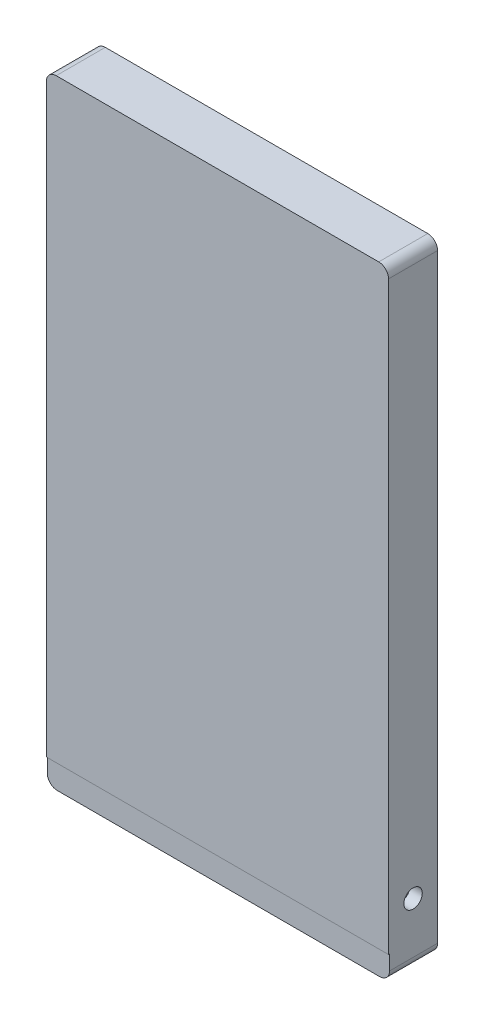
ISO-10303-21;
HEADER;
FILE_DESCRIPTION(('STEP AP214'),'2;1');
FILE_NAME('part.step','',(''),(''),'','','');
FILE_SCHEMA(('AUTOMOTIVE_DESIGN { 1 0 10303 214 1 1 1 1 }'));
ENDSEC;
DATA;
#1=APPLICATION_CONTEXT('core data for automotive mechanical design processes');
#2=APPLICATION_PROTOCOL_DEFINITION('international standard','automotive_design',2000,#1);
#3=PRODUCT_CONTEXT('',#1,'mechanical');
#4=PRODUCT('Part','Part','',(#3));
#5=PRODUCT_RELATED_PRODUCT_CATEGORY('part','',(#4));
#6=PRODUCT_DEFINITION_FORMATION('','',#4);
#7=PRODUCT_DEFINITION_CONTEXT('part definition',#1,'design');
#8=PRODUCT_DEFINITION('design','',#6,#7);
#9=PRODUCT_DEFINITION_SHAPE('','',#8);
#10=(LENGTH_UNIT() NAMED_UNIT(*) SI_UNIT(.MILLI.,.METRE.));
#11=(NAMED_UNIT(*) PLANE_ANGLE_UNIT() SI_UNIT($,.RADIAN.));
#12=(NAMED_UNIT(*) SI_UNIT($,.STERADIAN.) SOLID_ANGLE_UNIT());
#13=UNCERTAINTY_MEASURE_WITH_UNIT(LENGTH_MEASURE(1.E-05),#10,'distance_accuracy_value','');
#14=(GEOMETRIC_REPRESENTATION_CONTEXT(3) GLOBAL_UNCERTAINTY_ASSIGNED_CONTEXT((#13)) GLOBAL_UNIT_ASSIGNED_CONTEXT((#10,
#11,#12)) REPRESENTATION_CONTEXT('',''));
#15=CARTESIAN_POINT('',(0.,0.,0.));
#16=DIRECTION('',(0.,0.,1.));
#17=DIRECTION('',(1.,0.,0.));
#18=AXIS2_PLACEMENT_3D('',#15,#16,#17);
#19=CARTESIAN_POINT('',(-3.175,-3.175,12.7));
#20=DIRECTION('',(0.,1.,0.));
#21=DIRECTION('',(0.,0.,1.));
#22=AXIS2_PLACEMENT_3D('',#19,#20,#21);
#23=PLANE('',#22);
#24=DIRECTION('',(-1.,0.,0.));
#25=VECTOR('',#24,1.);
#26=CARTESIAN_POINT('',(-3.175,-3.175,12.4478002282018));
#27=LINE('',#26,#25);
#28=CARTESIAN_POINT('',(85.344,-3.175,12.4478002282018));
#29=VERTEX_POINT('',#28);
#30=CARTESIAN_POINT('',(-3.175,-3.175,12.4478002282018));
#31=VERTEX_POINT('',#30);
#32=EDGE_CURVE('E159',#29,#31,#27,.T.);
#33=ORIENTED_EDGE('',*,*,#32,.F.);
#34=DIRECTION('',(0.,0.,-1.));
#35=VECTOR('',#34,1.);
#36=CARTESIAN_POINT('',(85.344,-3.175,12.7));
#37=LINE('',#36,#35);
#38=CARTESIAN_POINT('',(85.344,-3.175,12.7));
#39=VERTEX_POINT('',#38);
#40=EDGE_CURVE('E165',#39,#29,#37,.T.);
#41=ORIENTED_EDGE('',*,*,#40,.F.);
#42=DIRECTION('',(1.,0.,0.));
#43=VECTOR('',#42,1.);
#44=CARTESIAN_POINT('',(-3.175,-3.175,12.7));
#45=LINE('',#44,#43);
#46=CARTESIAN_POINT('',(-3.175,-3.175,12.7));
#47=VERTEX_POINT('',#46);
#48=EDGE_CURVE('E162',#47,#39,#45,.T.);
#49=ORIENTED_EDGE('',*,*,#48,.F.);
#50=DIRECTION('',(0.,0.,-1.));
#51=VECTOR('',#50,1.);
#52=CARTESIAN_POINT('',(-3.175,-3.175,12.7));
#53=LINE('',#52,#51);
#54=EDGE_CURVE('E145',#47,#31,#53,.T.);
#55=ORIENTED_EDGE('',*,*,#54,.T.);
#56=EDGE_LOOP('',(#33,#41,#49,#55));
#57=FACE_BOUND('',#56,.T.);
#58=ADVANCED_FACE('F39',(#57),#23,.F.);
#59=CARTESIAN_POINT('',(0.,0.,0.));
#60=DIRECTION('',(0.,0.,1.));
#61=DIRECTION('',(1.,0.,0.));
#62=AXIS2_PLACEMENT_3D('',#59,#60,#61);
#63=PLANE('',#62);
#64=DIRECTION('',(0.,1.,0.));
#65=VECTOR('',#64,1.);
#66=CARTESIAN_POINT('',(85.344,-3.175,0.));
#67=LINE('',#66,#65);
#68=CARTESIAN_POINT('',(85.344,-6.985,0.));
#69=VERTEX_POINT('',#68);
#70=CARTESIAN_POINT('',(85.344,148.209,0.));
#71=VERTEX_POINT('',#70);
#72=EDGE_CURVE('E239',#69,#71,#67,.T.);
#73=ORIENTED_EDGE('',*,*,#72,.F.);
#74=CARTESIAN_POINT('',(82.804,-6.985,0.));
#75=DIRECTION('',(0.,0.,1.));
#76=DIRECTION('',(1.,0.,0.));
#77=AXIS2_PLACEMENT_3D('',#74,#75,#76);
#78=CIRCLE('',#77,2.54);
#79=CARTESIAN_POINT('',(82.804,-9.525,0.));
#80=VERTEX_POINT('',#79);
#81=EDGE_CURVE('E295',#69,#80,#78,.F.);
#82=ORIENTED_EDGE('',*,*,#81,.T.);
#83=DIRECTION('',(1.,0.,0.));
#84=VECTOR('',#83,1.);
#85=CARTESIAN_POINT('',(-3.175,-9.525,0.));
#86=LINE('',#85,#84);
#87=CARTESIAN_POINT('',(-0.635,-9.525,0.));
#88=VERTEX_POINT('',#87);
#89=EDGE_CURVE('E172',#88,#80,#86,.T.);
#90=ORIENTED_EDGE('',*,*,#89,.F.);
#91=CARTESIAN_POINT('',(-0.635,-6.985,0.));
#92=DIRECTION('',(0.,0.,1.));
#93=DIRECTION('',(1.,0.,0.));
#94=AXIS2_PLACEMENT_3D('',#91,#92,#93);
#95=CIRCLE('',#94,2.54);
#96=CARTESIAN_POINT('',(-3.175,-6.985,0.));
#97=VERTEX_POINT('',#96);
#98=EDGE_CURVE('E292',#88,#97,#95,.F.);
#99=ORIENTED_EDGE('',*,*,#98,.T.);
#100=DIRECTION('',(0.,1.,0.));
#101=VECTOR('',#100,1.);
#102=CARTESIAN_POINT('',(-3.175,-3.175,0.));
#103=LINE('',#102,#101);
#104=CARTESIAN_POINT('',(-3.175,148.209,0.));
#105=VERTEX_POINT('',#104);
#106=EDGE_CURVE('E243',#97,#105,#103,.T.);
#107=ORIENTED_EDGE('',*,*,#106,.T.);
#108=CARTESIAN_POINT('',(-0.635,148.209,0.));
#109=DIRECTION('',(0.,0.,1.));
#110=DIRECTION('',(1.,0.,0.));
#111=AXIS2_PLACEMENT_3D('',#108,#109,#110);
#112=CIRCLE('',#111,2.54);
#113=CARTESIAN_POINT('',(-0.635,150.749,0.));
#114=VERTEX_POINT('',#113);
#115=EDGE_CURVE('E289',#105,#114,#112,.F.);
#116=ORIENTED_EDGE('',*,*,#115,.T.);
#117=DIRECTION('',(1.,0.,0.));
#118=VECTOR('',#117,1.);
#119=CARTESIAN_POINT('',(-3.175,150.749,0.));
#120=LINE('',#119,#118);
#121=CARTESIAN_POINT('',(82.804,150.749,0.));
#122=VERTEX_POINT('',#121);
#123=EDGE_CURVE('E254',#114,#122,#120,.T.);
#124=ORIENTED_EDGE('',*,*,#123,.T.);
#125=CARTESIAN_POINT('',(82.804,148.209,0.));
#126=DIRECTION('',(0.,0.,1.));
#127=DIRECTION('',(1.,0.,0.));
#128=AXIS2_PLACEMENT_3D('',#125,#126,#127);
#129=CIRCLE('',#128,2.54);
#130=EDGE_CURVE('E286',#122,#71,#129,.F.);
#131=ORIENTED_EDGE('',*,*,#130,.T.);
#132=EDGE_LOOP('',(#73,#82,#90,#99,#107,#116,#124,#131));
#133=FACE_BOUND('',#132,.T.);
#134=DIRECTION('',(1.,0.,0.));
#135=VECTOR('',#134,1.);
#136=CARTESIAN_POINT('',(0.,0.,0.));
#137=LINE('',#136,#135);
#138=CARTESIAN_POINT('',(0.,0.,0.));
#139=VERTEX_POINT('',#138);
#140=CARTESIAN_POINT('',(82.169,0.,0.));
#141=VERTEX_POINT('',#140);
#142=EDGE_CURVE('E194',#139,#141,#137,.T.);
#143=ORIENTED_EDGE('',*,*,#142,.T.);
#144=DIRECTION('',(0.,1.,0.));
#145=VECTOR('',#144,1.);
#146=CARTESIAN_POINT('',(82.169,0.,0.));
#147=LINE('',#146,#145);
#148=CARTESIAN_POINT('',(82.169,147.574,0.));
#149=VERTEX_POINT('',#148);
#150=EDGE_CURVE('E215',#141,#149,#147,.T.);
#151=ORIENTED_EDGE('',*,*,#150,.T.);
#152=DIRECTION('',(1.,0.,0.));
#153=VECTOR('',#152,1.);
#154=CARTESIAN_POINT('',(0.,147.574,0.));
#155=LINE('',#154,#153);
#156=CARTESIAN_POINT('',(0.,147.574,0.));
#157=VERTEX_POINT('',#156);
#158=EDGE_CURVE('E219',#157,#149,#155,.T.);
#159=ORIENTED_EDGE('',*,*,#158,.F.);
#160=DIRECTION('',(0.,1.,0.));
#161=VECTOR('',#160,1.);
#162=CARTESIAN_POINT('',(0.,0.,0.));
#163=LINE('',#162,#161);
#164=EDGE_CURVE('E200',#139,#157,#163,.T.);
#165=ORIENTED_EDGE('',*,*,#164,.F.);
#166=EDGE_LOOP('',(#143,#151,#159,#165));
#167=FACE_BOUND('',#166,.T.);
#168=ADVANCED_FACE('F321',(#133,#167),#63,.F.);
#169=CARTESIAN_POINT('',(85.344,-3.175,12.7));
#170=DIRECTION('',(-1.,0.,0.));
#171=DIRECTION('',(0.,0.,1.));
#172=AXIS2_PLACEMENT_3D('',#169,#170,#171);
#173=PLANE('',#172);
#174=CARTESIAN_POINT('',(85.344,6.2179988861084,6.35000000000001));
#175=DIRECTION('',(1.,0.,0.));
#176=DIRECTION('',(0.,0.,-1.));
#177=AXIS2_PLACEMENT_3D('',#174,#175,#176);
#178=CIRCLE('',#177,2.38125);
#179=CARTESIAN_POINT('',(85.344,6.2179988861084,3.96875000000001));
#180=VERTEX_POINT('',#179);
#181=EDGE_CURVE('E181',#180,#180,#178,.T.);
#182=ORIENTED_EDGE('',*,*,#181,.F.);
#183=EDGE_LOOP('',(#182));
#184=FACE_BOUND('',#183,.T.);
#185=DIRECTION('',(0.,1.,0.));
#186=VECTOR('',#185,1.);
#187=CARTESIAN_POINT('',(85.344,-9.525,12.4478002282018));
#188=LINE('',#187,#186);
#189=CARTESIAN_POINT('',(85.344,-6.985,12.4478002282018));
#190=VERTEX_POINT('',#189);
#191=EDGE_CURVE('E153',#190,#29,#188,.T.);
#192=ORIENTED_EDGE('',*,*,#191,.F.);
#193=DIRECTION('',(0.,0.,1.));
#194=VECTOR('',#193,1.);
#195=CARTESIAN_POINT('',(85.344,-6.985,0.));
#196=LINE('',#195,#194);
#197=EDGE_CURVE('E283',#190,#69,#196,.F.);
#198=ORIENTED_EDGE('',*,*,#197,.T.);
#199=ORIENTED_EDGE('',*,*,#72,.T.);
#200=DIRECTION('',(0.,0.,-1.));
#201=VECTOR('',#200,1.);
#202=CARTESIAN_POINT('',(85.344,148.209,12.7));
#203=LINE('',#202,#201);
#204=CARTESIAN_POINT('',(85.344,148.209,12.7));
#205=VERTEX_POINT('',#204);
#206=EDGE_CURVE('E280',#71,#205,#203,.F.);
#207=ORIENTED_EDGE('',*,*,#206,.T.);
#208=DIRECTION('',(0.,1.,0.));
#209=VECTOR('',#208,1.);
#210=CARTESIAN_POINT('',(85.344,-3.175,12.7));
#211=LINE('',#210,#209);
#212=EDGE_CURVE('E242',#39,#205,#211,.T.);
#213=ORIENTED_EDGE('',*,*,#212,.F.);
#214=ORIENTED_EDGE('',*,*,#40,.T.);
#215=EDGE_LOOP('',(#192,#198,#199,#207,#213,#214));
#216=FACE_BOUND('',#215,.T.);
#217=ADVANCED_FACE('F333',(#184,#216),#173,.F.);
#218=CARTESIAN_POINT('',(-3.175,150.749,12.7));
#219=DIRECTION('',(0.,1.,0.));
#220=DIRECTION('',(0.,0.,1.));
#221=AXIS2_PLACEMENT_3D('',#218,#219,#220);
#222=PLANE('',#221);
#223=ORIENTED_EDGE('',*,*,#123,.F.);
#224=DIRECTION('',(0.,0.,-1.));
#225=VECTOR('',#224,1.);
#226=CARTESIAN_POINT('',(-0.635,150.749,12.7));
#227=LINE('',#226,#225);
#228=CARTESIAN_POINT('',(-0.635,150.749,12.7));
#229=VERTEX_POINT('',#228);
#230=EDGE_CURVE('E61',#114,#229,#227,.F.);
#231=ORIENTED_EDGE('',*,*,#230,.T.);
#232=DIRECTION('',(1.,0.,0.));
#233=VECTOR('',#232,1.);
#234=CARTESIAN_POINT('',(-3.175,150.749,12.7));
#235=LINE('',#234,#233);
#236=CARTESIAN_POINT('',(82.804,150.749,12.7));
#237=VERTEX_POINT('',#236);
#238=EDGE_CURVE('E246',#229,#237,#235,.T.);
#239=ORIENTED_EDGE('',*,*,#238,.T.);
#240=DIRECTION('',(0.,0.,-1.));
#241=VECTOR('',#240,1.);
#242=CARTESIAN_POINT('',(82.804,150.749,0.));
#243=LINE('',#242,#241);
#244=EDGE_CURVE('E304',#237,#122,#243,.T.);
#245=ORIENTED_EDGE('',*,*,#244,.T.);
#246=EDGE_LOOP('',(#223,#231,#239,#245));
#247=FACE_BOUND('',#246,.T.);
#248=ADVANCED_FACE('F327',(#247),#222,.T.);
#249=CARTESIAN_POINT('',(-3.175,-3.175,12.7));
#250=DIRECTION('',(-1.,0.,0.));
#251=DIRECTION('',(0.,0.,1.));
#252=AXIS2_PLACEMENT_3D('',#249,#250,#251);
#253=PLANE('',#252);
#254=CARTESIAN_POINT('',(-3.175,6.2179988861084,6.35000000000001));
#255=DIRECTION('',(-1.,0.,0.));
#256=DIRECTION('',(0.,0.,1.));
#257=AXIS2_PLACEMENT_3D('',#254,#255,#256);
#258=CIRCLE('',#257,2.38125);
#259=CARTESIAN_POINT('',(-3.175,6.2179988861084,8.73125000000002));
#260=VERTEX_POINT('',#259);
#261=EDGE_CURVE('E190',#260,#260,#258,.T.);
#262=ORIENTED_EDGE('',*,*,#261,.F.);
#263=EDGE_LOOP('',(#262));
#264=FACE_BOUND('',#263,.T.);
#265=ORIENTED_EDGE('',*,*,#106,.F.);
#266=DIRECTION('',(0.,0.,-1.));
#267=VECTOR('',#266,1.);
#268=CARTESIAN_POINT('',(-3.175,-6.985,12.7));
#269=LINE('',#268,#267);
#270=CARTESIAN_POINT('',(-3.175,-6.985,12.4478002282018));
#271=VERTEX_POINT('',#270);
#272=EDGE_CURVE('E148',#97,#271,#269,.F.);
#273=ORIENTED_EDGE('',*,*,#272,.T.);
#274=DIRECTION('',(0.,1.,0.));
#275=VECTOR('',#274,1.);
#276=CARTESIAN_POINT('',(-3.175,-9.525,12.4478002282018));
#277=LINE('',#276,#275);
#278=EDGE_CURVE('E140',#271,#31,#277,.T.);
#279=ORIENTED_EDGE('',*,*,#278,.T.);
#280=ORIENTED_EDGE('',*,*,#54,.F.);
#281=DIRECTION('',(0.,1.,0.));
#282=VECTOR('',#281,1.);
#283=CARTESIAN_POINT('',(-3.175,-3.175,12.7));
#284=LINE('',#283,#282);
#285=CARTESIAN_POINT('',(-3.175,148.209,12.7));
#286=VERTEX_POINT('',#285);
#287=EDGE_CURVE('E166',#47,#286,#284,.T.);
#288=ORIENTED_EDGE('',*,*,#287,.T.);
#289=DIRECTION('',(0.,0.,-1.));
#290=VECTOR('',#289,1.);
#291=CARTESIAN_POINT('',(-3.175,148.209,12.7));
#292=LINE('',#291,#290);
#293=EDGE_CURVE('E298',#286,#105,#292,.T.);
#294=ORIENTED_EDGE('',*,*,#293,.T.);
#295=EDGE_LOOP('',(#265,#273,#279,#280,#288,#294));
#296=FACE_BOUND('',#295,.T.);
#297=ADVANCED_FACE('F143',(#264,#296),#253,.T.);
#298=CARTESIAN_POINT('',(0.,0.,12.7));
#299=DIRECTION('',(0.,0.,1.));
#300=DIRECTION('',(1.,0.,0.));
#301=AXIS2_PLACEMENT_3D('',#298,#299,#300);
#302=PLANE('',#301);
#303=ORIENTED_EDGE('',*,*,#238,.F.);
#304=CARTESIAN_POINT('',(-0.635,148.209,12.7));
#305=DIRECTION('',(0.,0.,1.));
#306=DIRECTION('',(1.,0.,0.));
#307=AXIS2_PLACEMENT_3D('',#304,#305,#306);
#308=CIRCLE('',#307,2.54);
#309=EDGE_CURVE('E11',#229,#286,#308,.T.);
#310=ORIENTED_EDGE('',*,*,#309,.T.);
#311=ORIENTED_EDGE('',*,*,#287,.F.);
#312=ORIENTED_EDGE('',*,*,#48,.T.);
#313=ORIENTED_EDGE('',*,*,#212,.T.);
#314=CARTESIAN_POINT('',(82.804,148.209,12.7));
#315=DIRECTION('',(0.,0.,1.));
#316=DIRECTION('',(1.,0.,0.));
#317=AXIS2_PLACEMENT_3D('',#314,#315,#316);
#318=CIRCLE('',#317,2.54);
#319=EDGE_CURVE('E48',#205,#237,#318,.T.);
#320=ORIENTED_EDGE('',*,*,#319,.T.);
#321=EDGE_LOOP('',(#303,#310,#311,#312,#313,#320));
#322=FACE_BOUND('',#321,.T.);
#323=ADVANCED_FACE('F358',(#322),#302,.T.);
#324=CARTESIAN_POINT('',(0.,0.,10.16));
#325=DIRECTION('',(0.,1.,0.));
#326=DIRECTION('',(0.,0.,1.));
#327=AXIS2_PLACEMENT_3D('',#324,#325,#326);
#328=PLANE('',#327);
#329=ORIENTED_EDGE('',*,*,#142,.F.);
#330=DIRECTION('',(0.,0.,-1.));
#331=VECTOR('',#330,1.);
#332=CARTESIAN_POINT('',(0.,0.,10.16));
#333=LINE('',#332,#331);
#334=CARTESIAN_POINT('',(0.,0.,10.16));
#335=VERTEX_POINT('',#334);
#336=EDGE_CURVE('E211',#335,#139,#333,.T.);
#337=ORIENTED_EDGE('',*,*,#336,.F.);
#338=DIRECTION('',(1.,0.,0.));
#339=VECTOR('',#338,1.);
#340=CARTESIAN_POINT('',(0.,0.,10.16));
#341=LINE('',#340,#339);
#342=CARTESIAN_POINT('',(82.169,0.,10.16));
#343=VERTEX_POINT('',#342);
#344=EDGE_CURVE('E195',#335,#343,#341,.T.);
#345=ORIENTED_EDGE('',*,*,#344,.T.);
#346=DIRECTION('',(0.,0.,-1.));
#347=VECTOR('',#346,1.);
#348=CARTESIAN_POINT('',(82.169,0.,10.16));
#349=LINE('',#348,#347);
#350=EDGE_CURVE('E235',#343,#141,#349,.T.);
#351=ORIENTED_EDGE('',*,*,#350,.T.);
#352=EDGE_LOOP('',(#329,#337,#345,#351));
#353=FACE_BOUND('',#352,.T.);
#354=ADVANCED_FACE('F363',(#353),#328,.T.);
#355=CARTESIAN_POINT('',(82.169,0.,10.16));
#356=DIRECTION('',(-1.,0.,0.));
#357=DIRECTION('',(0.,0.,1.));
#358=AXIS2_PLACEMENT_3D('',#355,#356,#357);
#359=PLANE('',#358);
#360=CARTESIAN_POINT('',(82.169,6.2179988861084,6.35000000000001));
#361=DIRECTION('',(-1.,0.,0.));
#362=DIRECTION('',(0.,0.,1.));
#363=AXIS2_PLACEMENT_3D('',#360,#361,#362);
#364=CIRCLE('',#363,2.38125);
#365=CARTESIAN_POINT('',(82.169,6.2179988861084,8.73125000000002));
#366=VERTEX_POINT('',#365);
#367=EDGE_CURVE('E186',#366,#366,#364,.T.);
#368=ORIENTED_EDGE('',*,*,#367,.F.);
#369=EDGE_LOOP('',(#368));
#370=FACE_BOUND('',#369,.T.);
#371=ORIENTED_EDGE('',*,*,#150,.F.);
#372=ORIENTED_EDGE('',*,*,#350,.F.);
#373=DIRECTION('',(0.,1.,0.));
#374=VECTOR('',#373,1.);
#375=CARTESIAN_POINT('',(82.169,0.,10.16));
#376=LINE('',#375,#374);
#377=CARTESIAN_POINT('',(82.169,147.574,10.16));
#378=VERTEX_POINT('',#377);
#379=EDGE_CURVE('E199',#343,#378,#376,.T.);
#380=ORIENTED_EDGE('',*,*,#379,.T.);
#381=DIRECTION('',(0.,0.,-1.));
#382=VECTOR('',#381,1.);
#383=CARTESIAN_POINT('',(82.169,147.574,10.16));
#384=LINE('',#383,#382);
#385=EDGE_CURVE('E232',#378,#149,#384,.T.);
#386=ORIENTED_EDGE('',*,*,#385,.T.);
#387=EDGE_LOOP('',(#371,#372,#380,#386));
#388=FACE_BOUND('',#387,.T.);
#389=ADVANCED_FACE('F366',(#370,#388),#359,.T.);
#390=CARTESIAN_POINT('',(0.,147.574,10.16));
#391=DIRECTION('',(0.,1.,0.));
#392=DIRECTION('',(0.,0.,1.));
#393=AXIS2_PLACEMENT_3D('',#390,#391,#392);
#394=PLANE('',#393);
#395=ORIENTED_EDGE('',*,*,#158,.T.);
#396=ORIENTED_EDGE('',*,*,#385,.F.);
#397=DIRECTION('',(1.,0.,0.));
#398=VECTOR('',#397,1.);
#399=CARTESIAN_POINT('',(0.,147.574,10.16));
#400=LINE('',#399,#398);
#401=CARTESIAN_POINT('',(0.,147.574,10.16));
#402=VERTEX_POINT('',#401);
#403=EDGE_CURVE('E203',#402,#378,#400,.T.);
#404=ORIENTED_EDGE('',*,*,#403,.F.);
#405=DIRECTION('',(0.,0.,-1.));
#406=VECTOR('',#405,1.);
#407=CARTESIAN_POINT('',(0.,147.574,10.16));
#408=LINE('',#407,#406);
#409=EDGE_CURVE('E229',#402,#157,#408,.T.);
#410=ORIENTED_EDGE('',*,*,#409,.T.);
#411=EDGE_LOOP('',(#395,#396,#404,#410));
#412=FACE_BOUND('',#411,.T.);
#413=ADVANCED_FACE('F370',(#412),#394,.F.);
#414=CARTESIAN_POINT('',(0.,0.,10.16));
#415=DIRECTION('',(-1.,0.,0.));
#416=DIRECTION('',(0.,0.,1.));
#417=AXIS2_PLACEMENT_3D('',#414,#415,#416);
#418=PLANE('',#417);
#419=CARTESIAN_POINT('',(0.,6.2179988861084,6.35000000000001));
#420=DIRECTION('',(-1.,0.,0.));
#421=DIRECTION('',(0.,0.,1.));
#422=AXIS2_PLACEMENT_3D('',#419,#420,#421);
#423=CIRCLE('',#422,2.38125);
#424=CARTESIAN_POINT('',(0.,6.2179988861084,8.73125000000002));
#425=VERTEX_POINT('',#424);
#426=EDGE_CURVE('E185',#425,#425,#423,.T.);
#427=ORIENTED_EDGE('',*,*,#426,.T.);
#428=EDGE_LOOP('',(#427));
#429=FACE_BOUND('',#428,.T.);
#430=ORIENTED_EDGE('',*,*,#164,.T.);
#431=ORIENTED_EDGE('',*,*,#409,.F.);
#432=DIRECTION('',(0.,1.,0.));
#433=VECTOR('',#432,1.);
#434=CARTESIAN_POINT('',(0.,0.,10.16));
#435=LINE('',#434,#433);
#436=EDGE_CURVE('E207',#335,#402,#435,.T.);
#437=ORIENTED_EDGE('',*,*,#436,.F.);
#438=ORIENTED_EDGE('',*,*,#336,.T.);
#439=EDGE_LOOP('',(#430,#431,#437,#438));
#440=FACE_BOUND('',#439,.T.);
#441=ADVANCED_FACE('F374',(#429,#440),#418,.F.);
#442=CARTESIAN_POINT('',(0.,0.,10.16));
#443=DIRECTION('',(0.,0.,1.));
#444=DIRECTION('',(1.,0.,0.));
#445=AXIS2_PLACEMENT_3D('',#442,#443,#444);
#446=PLANE('',#445);
#447=ORIENTED_EDGE('',*,*,#344,.F.);
#448=ORIENTED_EDGE('',*,*,#436,.T.);
#449=ORIENTED_EDGE('',*,*,#403,.T.);
#450=ORIENTED_EDGE('',*,*,#379,.F.);
#451=EDGE_LOOP('',(#447,#448,#449,#450));
#452=FACE_BOUND('',#451,.T.);
#453=ADVANCED_FACE('F378',(#452),#446,.F.);
#454=CARTESIAN_POINT('',(-44.1960000000001,6.2179988861084,6.35000000000001));
#455=DIRECTION('',(1.,0.,0.));
#456=DIRECTION('',(0.,0.,-1.));
#457=AXIS2_PLACEMENT_3D('',#454,#455,#456);
#458=CYLINDRICAL_SURFACE('',#457,2.38125);
#459=ORIENTED_EDGE('',*,*,#261,.T.);
#460=EDGE_LOOP('',(#459));
#461=FACE_BOUND('',#460,.T.);
#462=ORIENTED_EDGE('',*,*,#426,.F.);
#463=EDGE_LOOP('',(#462));
#464=FACE_BOUND('',#463,.T.);
#465=ADVANCED_FACE('F382',(#461,#464),#458,.F.);
#466=ORIENTED_EDGE('',*,*,#367,.T.);
#467=EDGE_LOOP('',(#466));
#468=FACE_BOUND('',#467,.T.);
#469=ORIENTED_EDGE('',*,*,#181,.T.);
#470=EDGE_LOOP('',(#469));
#471=FACE_BOUND('',#470,.T.);
#472=ADVANCED_FACE('F384',(#468,#471),#458,.F.);
#473=CARTESIAN_POINT('',(-3.175,-9.525,12.4478002282018));
#474=DIRECTION('',(0.,0.,-1.));
#475=DIRECTION('',(-1.,0.,0.));
#476=AXIS2_PLACEMENT_3D('',#473,#474,#475);
#477=PLANE('',#476);
#478=DIRECTION('',(-1.,0.,0.));
#479=VECTOR('',#478,1.);
#480=CARTESIAN_POINT('',(-3.175,-9.525,12.4478002282018));
#481=LINE('',#480,#479);
#482=CARTESIAN_POINT('',(82.804,-9.525,12.4478002282018));
#483=VERTEX_POINT('',#482);
#484=CARTESIAN_POINT('',(-0.635,-9.525,12.4478002282018));
#485=VERTEX_POINT('',#484);
#486=EDGE_CURVE('E154',#483,#485,#481,.T.);
#487=ORIENTED_EDGE('',*,*,#486,.F.);
#488=CARTESIAN_POINT('',(82.804,-6.985,12.4478002282018));
#489=DIRECTION('',(0.,0.,-1.));
#490=DIRECTION('',(-1.,0.,0.));
#491=AXIS2_PLACEMENT_3D('',#488,#489,#490);
#492=CIRCLE('',#491,2.54);
#493=EDGE_CURVE('E277',#483,#190,#492,.F.);
#494=ORIENTED_EDGE('',*,*,#493,.T.);
#495=ORIENTED_EDGE('',*,*,#191,.T.);
#496=ORIENTED_EDGE('',*,*,#32,.T.);
#497=ORIENTED_EDGE('',*,*,#278,.F.);
#498=CARTESIAN_POINT('',(-0.635,-6.985,12.4478002282018));
#499=DIRECTION('',(0.,0.,-1.));
#500=DIRECTION('',(-1.,0.,0.));
#501=AXIS2_PLACEMENT_3D('',#498,#499,#500);
#502=CIRCLE('',#501,2.54);
#503=EDGE_CURVE('E274',#271,#485,#502,.F.);
#504=ORIENTED_EDGE('',*,*,#503,.T.);
#505=EDGE_LOOP('',(#487,#494,#495,#496,#497,#504));
#506=FACE_BOUND('',#505,.T.);
#507=ADVANCED_FACE('F169',(#506),#477,.F.);
#508=CARTESIAN_POINT('',(0.,-9.525,0.));
#509=DIRECTION('',(0.,-1.,0.));
#510=DIRECTION('',(0.,0.,-1.));
#511=AXIS2_PLACEMENT_3D('',#508,#509,#510);
#512=PLANE('',#511);
#513=ORIENTED_EDGE('',*,*,#89,.T.);
#514=DIRECTION('',(0.,0.,1.));
#515=VECTOR('',#514,1.);
#516=CARTESIAN_POINT('',(82.804,-9.525,12.4478002282018));
#517=LINE('',#516,#515);
#518=EDGE_CURVE('E270',#80,#483,#517,.T.);
#519=ORIENTED_EDGE('',*,*,#518,.T.);
#520=ORIENTED_EDGE('',*,*,#486,.T.);
#521=DIRECTION('',(0.,0.,-1.));
#522=VECTOR('',#521,1.);
#523=CARTESIAN_POINT('',(-0.635,-9.525,0.));
#524=LINE('',#523,#522);
#525=EDGE_CURVE('E263',#485,#88,#524,.T.);
#526=ORIENTED_EDGE('',*,*,#525,.T.);
#527=EDGE_LOOP('',(#513,#519,#520,#526));
#528=FACE_BOUND('',#527,.T.);
#529=ADVANCED_FACE('F314',(#528),#512,.T.);
#530=CARTESIAN_POINT('',(82.804,-6.985,0.));
#531=DIRECTION('',(0.,0.,-1.));
#532=DIRECTION('',(-1.,0.,0.));
#533=AXIS2_PLACEMENT_3D('',#530,#531,#532);
#534=CYLINDRICAL_SURFACE('',#533,2.54);
#535=ORIENTED_EDGE('',*,*,#81,.F.);
#536=ORIENTED_EDGE('',*,*,#197,.F.);
#537=ORIENTED_EDGE('',*,*,#493,.F.);
#538=ORIENTED_EDGE('',*,*,#518,.F.);
#539=EDGE_LOOP('',(#535,#536,#537,#538));
#540=FACE_BOUND('',#539,.T.);
#541=ADVANCED_FACE('F336',(#540),#534,.T.);
#542=CARTESIAN_POINT('',(-0.635,-6.985,0.));
#543=DIRECTION('',(0.,0.,-1.));
#544=DIRECTION('',(-1.,0.,0.));
#545=AXIS2_PLACEMENT_3D('',#542,#543,#544);
#546=CYLINDRICAL_SURFACE('',#545,2.54);
#547=ORIENTED_EDGE('',*,*,#503,.F.);
#548=ORIENTED_EDGE('',*,*,#272,.F.);
#549=ORIENTED_EDGE('',*,*,#98,.F.);
#550=ORIENTED_EDGE('',*,*,#525,.F.);
#551=EDGE_LOOP('',(#547,#548,#549,#550));
#552=FACE_BOUND('',#551,.T.);
#553=ADVANCED_FACE('F318',(#552),#546,.T.);
#554=CARTESIAN_POINT('',(-0.635,148.209,12.7));
#555=DIRECTION('',(0.,0.,-1.));
#556=DIRECTION('',(-1.,0.,0.));
#557=AXIS2_PLACEMENT_3D('',#554,#555,#556);
#558=CYLINDRICAL_SURFACE('',#557,2.54);
#559=ORIENTED_EDGE('',*,*,#309,.F.);
#560=ORIENTED_EDGE('',*,*,#230,.F.);
#561=ORIENTED_EDGE('',*,*,#115,.F.);
#562=ORIENTED_EDGE('',*,*,#293,.F.);
#563=EDGE_LOOP('',(#559,#560,#561,#562));
#564=FACE_BOUND('',#563,.T.);
#565=ADVANCED_FACE('F326',(#564),#558,.T.);
#566=CARTESIAN_POINT('',(82.804,148.209,12.7));
#567=DIRECTION('',(0.,0.,1.));
#568=DIRECTION('',(1.,0.,0.));
#569=AXIS2_PLACEMENT_3D('',#566,#567,#568);
#570=CYLINDRICAL_SURFACE('',#569,2.54);
#571=ORIENTED_EDGE('',*,*,#319,.F.);
#572=ORIENTED_EDGE('',*,*,#206,.F.);
#573=ORIENTED_EDGE('',*,*,#130,.F.);
#574=ORIENTED_EDGE('',*,*,#244,.F.);
#575=EDGE_LOOP('',(#571,#572,#573,#574));
#576=FACE_BOUND('',#575,.T.);
#577=ADVANCED_FACE('F41',(#576),#570,.T.);
#578=CLOSED_SHELL('',(#58,#168,#217,#248,#297,#323,#354,#389,#413,#441,#453,#465,#472,#507,#529,
#541,#553,#565,#577));
#579=MANIFOLD_SOLID_BREP('B2',#578);
#580=ADVANCED_BREP_SHAPE_REPRESENTATION('',(#18,#579),#14);
#581=SHAPE_DEFINITION_REPRESENTATION(#9,#580);
ENDSEC;
END-ISO-10303-21;
